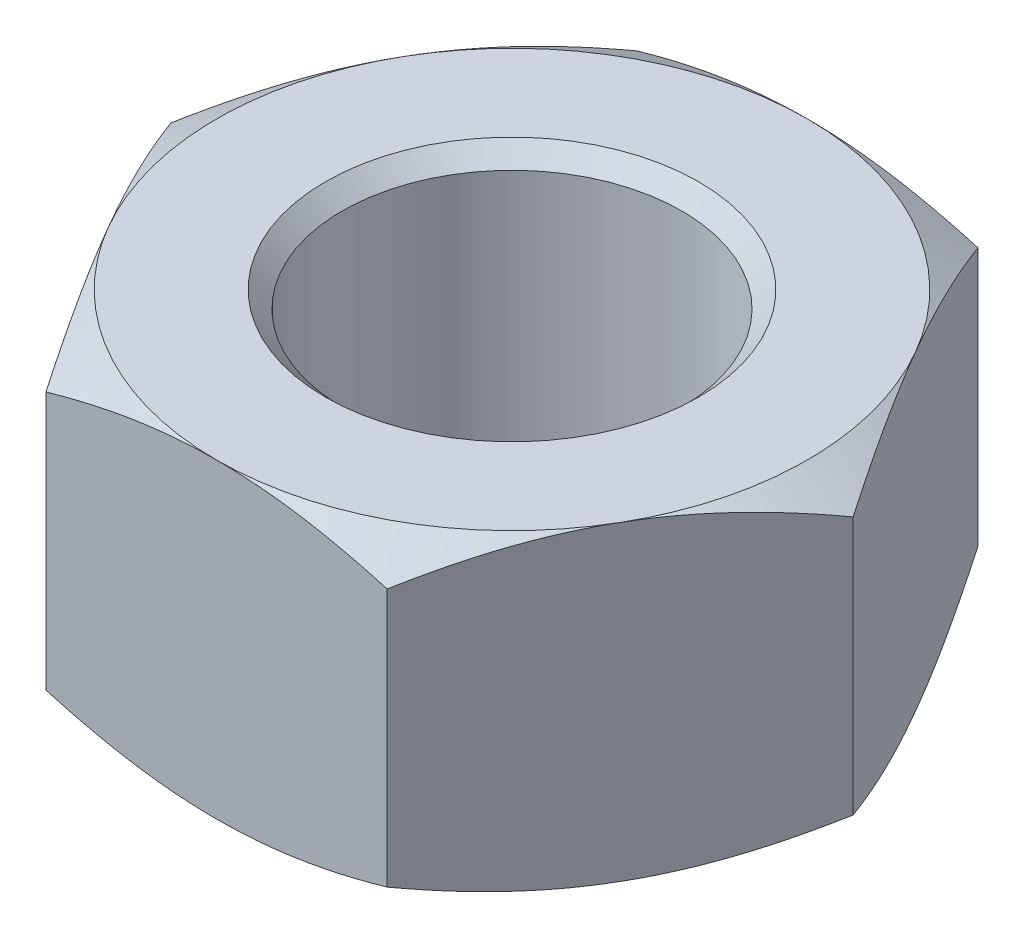
ISO-10303-21;
HEADER;
FILE_DESCRIPTION(('STEP AP214'),'2;1');
FILE_NAME('part.step','',(''),(''),'','','');
FILE_SCHEMA(('AUTOMOTIVE_DESIGN { 1 0 10303 214 1 1 1 1 }'));
ENDSEC;
DATA;
#1=APPLICATION_CONTEXT('core data for automotive mechanical design processes');
#2=APPLICATION_PROTOCOL_DEFINITION('international standard','automotive_design',2000,#1);
#3=PRODUCT_CONTEXT('',#1,'mechanical');
#4=PRODUCT('Part','Part','',(#3));
#5=PRODUCT_RELATED_PRODUCT_CATEGORY('part','',(#4));
#6=PRODUCT_DEFINITION_FORMATION('','',#4);
#7=PRODUCT_DEFINITION_CONTEXT('part definition',#1,'design');
#8=PRODUCT_DEFINITION('design','',#6,#7);
#9=PRODUCT_DEFINITION_SHAPE('','',#8);
#10=(LENGTH_UNIT() NAMED_UNIT(*) SI_UNIT(.MILLI.,.METRE.));
#11=(NAMED_UNIT(*) PLANE_ANGLE_UNIT() SI_UNIT($,.RADIAN.));
#12=(NAMED_UNIT(*) SI_UNIT($,.STERADIAN.) SOLID_ANGLE_UNIT());
#13=UNCERTAINTY_MEASURE_WITH_UNIT(LENGTH_MEASURE(1.E-05),#10,'distance_accuracy_value','');
#14=(GEOMETRIC_REPRESENTATION_CONTEXT(3) GLOBAL_UNCERTAINTY_ASSIGNED_CONTEXT((#13)) GLOBAL_UNIT_ASSIGNED_CONTEXT((#10,
#11,#12)) REPRESENTATION_CONTEXT('',''));
#15=CARTESIAN_POINT('',(0.,0.,0.));
#16=DIRECTION('',(0.,0.,1.));
#17=DIRECTION('',(1.,0.,0.));
#18=AXIS2_PLACEMENT_3D('',#15,#16,#17);
#19=CARTESIAN_POINT('',(-38.7727586640478,-29.,-4.75));
#20=DIRECTION('',(0.866025403784439,0.,-0.5));
#21=DIRECTION('',(-0.5,0.,-0.866025403784439));
#22=AXIS2_PLACEMENT_3D('',#19,#20,#21);
#23=PLANE('',#22);
#24=CARTESIAN_POINT('',(-41.5180162225476,-27.1498517286183,-9.50492557118405));
#25=CARTESIAN_POINT('',(-40.0466600833053,-28.,-6.95646198198795));
#26=CARTESIAN_POINT('',(-38.7727586640478,-28.,-4.75));
#27=CARTESIAN_POINT('',(-37.4988572447905,-28.,-2.54353801801205));
#28=CARTESIAN_POINT('',(-36.0275011055481,-27.1498517286183,0.00492557118405202));
#29=(BOUNDED_CURVE() B_SPLINE_CURVE(2,(#24,#25,#26,#27,#28),.UNSPECIFIED.,.F.,
.F.) B_SPLINE_CURVE_WITH_KNOTS((3,2,3),(0.,5.57015057763849,11.140301155277),
.UNSPECIFIED.) CURVE() GEOMETRIC_REPRESENTATION_ITEM() RATIONAL_B_SPLINE_CURVE((1.,
1.03802697460132,1.,1.03802697460132,1.)) REPRESENTATION_ITEM(''));
#30=CARTESIAN_POINT('',(-41.5151724426986,-27.1514942239681,-9.5));
#31=VERTEX_POINT('',#30);
#32=CARTESIAN_POINT('',(-38.7727586640478,-28.,-4.75));
#33=VERTEX_POINT('',#32);
#34=EDGE_CURVE('E120',#31,#33,#29,.T.);
#35=ORIENTED_EDGE('',*,*,#34,.F.);
#36=DIRECTION('',(0.,1.,0.));
#37=VECTOR('',#36,1.);
#38=CARTESIAN_POINT('',(-41.5151724426986,-29.,-9.5));
#39=LINE('',#38,#37);
#40=CARTESIAN_POINT('',(-41.5151724426986,-18.8485057760319,-9.5));
#41=VERTEX_POINT('',#40);
#42=EDGE_CURVE('E11',#31,#41,#39,.T.);
#43=ORIENTED_EDGE('',*,*,#42,.T.);
#44=CARTESIAN_POINT('',(-36.0275011055481,-18.8501482713817,0.00492557118405869));
#45=CARTESIAN_POINT('',(-37.4988572447904,-18.,-2.54353801801204));
#46=CARTESIAN_POINT('',(-38.7727586640478,-18.,-4.75));
#47=CARTESIAN_POINT('',(-40.0466600833052,-18.,-6.95646198198795));
#48=CARTESIAN_POINT('',(-41.5180162225476,-18.8501482713817,-9.50492557118406));
#49=(BOUNDED_CURVE() B_SPLINE_CURVE(2,(#44,#45,#46,#47,#48),.UNSPECIFIED.,.F.,
.F.) B_SPLINE_CURVE_WITH_KNOTS((3,2,3),(0.,5.57015057763849,11.140301155277),
.UNSPECIFIED.) CURVE() GEOMETRIC_REPRESENTATION_ITEM() RATIONAL_B_SPLINE_CURVE((1.,
1.03802697460132,1.,1.03802697460132,1.)) REPRESENTATION_ITEM(''));
#50=CARTESIAN_POINT('',(-38.7727586640478,-18.,-4.75));
#51=VERTEX_POINT('',#50);
#52=EDGE_CURVE('E204',#51,#41,#49,.T.);
#53=ORIENTED_EDGE('',*,*,#52,.F.);
#54=CARTESIAN_POINT('',(-36.0275011055481,-18.8501482713817,0.00492557118405869));
#55=CARTESIAN_POINT('',(-37.4988572447904,-18.,-2.54353801801204));
#56=CARTESIAN_POINT('',(-38.7727586640478,-18.,-4.75));
#57=CARTESIAN_POINT('',(-40.0466600833052,-18.,-6.95646198198795));
#58=CARTESIAN_POINT('',(-41.5180162225476,-18.8501482713817,-9.50492557118406));
#59=(BOUNDED_CURVE() B_SPLINE_CURVE(2,(#54,#55,#56,#57,#58),.UNSPECIFIED.,.F.,
.F.) B_SPLINE_CURVE_WITH_KNOTS((3,2,3),(0.,5.57015057763849,11.140301155277),
.UNSPECIFIED.) CURVE() GEOMETRIC_REPRESENTATION_ITEM() RATIONAL_B_SPLINE_CURVE((1.,
1.03802697460132,1.,1.03802697460132,1.)) REPRESENTATION_ITEM(''));
#60=CARTESIAN_POINT('',(-36.0303448853971,-18.8485057760319,0.));
#61=VERTEX_POINT('',#60);
#62=EDGE_CURVE('E305',#61,#51,#59,.T.);
#63=ORIENTED_EDGE('',*,*,#62,.F.);
#64=DIRECTION('',(0.,1.,0.));
#65=VECTOR('',#64,1.);
#66=CARTESIAN_POINT('',(-36.0303448853971,-29.,0.));
#67=LINE('',#66,#65);
#68=CARTESIAN_POINT('',(-36.0303448853971,-27.1514942239681,0.));
#69=VERTEX_POINT('',#68);
#70=EDGE_CURVE('E216',#69,#61,#67,.T.);
#71=ORIENTED_EDGE('',*,*,#70,.F.);
#72=CARTESIAN_POINT('',(-41.5180162225476,-27.1498517286183,-9.50492557118405));
#73=CARTESIAN_POINT('',(-40.0466600833053,-28.,-6.95646198198795));
#74=CARTESIAN_POINT('',(-38.7727586640478,-28.,-4.75));
#75=CARTESIAN_POINT('',(-37.4988572447905,-28.,-2.54353801801205));
#76=CARTESIAN_POINT('',(-36.0275011055481,-27.1498517286183,0.00492557118405202));
#77=(BOUNDED_CURVE() B_SPLINE_CURVE(2,(#72,#73,#74,#75,#76),.UNSPECIFIED.,.F.,
.F.) B_SPLINE_CURVE_WITH_KNOTS((3,2,3),(0.,5.57015057763849,11.140301155277),
.UNSPECIFIED.) CURVE() GEOMETRIC_REPRESENTATION_ITEM() RATIONAL_B_SPLINE_CURVE((1.,
1.03802697460132,1.,1.03802697460132,1.)) REPRESENTATION_ITEM(''));
#78=EDGE_CURVE('E123',#33,#69,#77,.T.);
#79=ORIENTED_EDGE('',*,*,#78,.F.);
#80=EDGE_LOOP('',(#35,#43,#53,#63,#71,#79));
#81=FACE_BOUND('',#80,.T.);
#82=ADVANCED_FACE('F16',(#81),#23,.T.);
#83=CARTESIAN_POINT('',(-47.,-29.,-9.5));
#84=DIRECTION('',(0.,0.,-1.));
#85=DIRECTION('',(-1.,0.,0.));
#86=AXIS2_PLACEMENT_3D('',#83,#84,#85);
#87=PLANE('',#86);
#88=CARTESIAN_POINT('',(-52.4905151169995,-27.1498517286183,-9.5));
#89=CARTESIAN_POINT('',(-49.5478028385149,-28.,-9.50000000000001));
#90=CARTESIAN_POINT('',(-47.,-28.,-9.5));
#91=CARTESIAN_POINT('',(-44.4521971614852,-28.,-9.50000000000001));
#92=CARTESIAN_POINT('',(-41.5094848830005,-27.1498517286183,-9.5));
#93=(BOUNDED_CURVE() B_SPLINE_CURVE(2,(#88,#89,#90,#91,#92),.UNSPECIFIED.,.F.,
.F.) B_SPLINE_CURVE_WITH_KNOTS((3,2,3),(0.,5.57015057763849,11.140301155277),
.UNSPECIFIED.) CURVE() GEOMETRIC_REPRESENTATION_ITEM() RATIONAL_B_SPLINE_CURVE((1.,
1.03802697460134,1.,1.03802697460134,1.)) REPRESENTATION_ITEM(''));
#94=CARTESIAN_POINT('',(-52.4848275573015,-27.1514942239681,-9.5));
#95=VERTEX_POINT('',#94);
#96=CARTESIAN_POINT('',(-47.,-28.,-9.5));
#97=VERTEX_POINT('',#96);
#98=EDGE_CURVE('E129',#95,#97,#93,.T.);
#99=ORIENTED_EDGE('',*,*,#98,.F.);
#100=DIRECTION('',(0.,1.,0.));
#101=VECTOR('',#100,1.);
#102=CARTESIAN_POINT('',(-52.4848275573015,-29.,-9.5));
#103=LINE('',#102,#101);
#104=CARTESIAN_POINT('',(-52.4848275573015,-18.8485057760319,-9.5));
#105=VERTEX_POINT('',#104);
#106=EDGE_CURVE('E28',#95,#105,#103,.T.);
#107=ORIENTED_EDGE('',*,*,#106,.T.);
#108=CARTESIAN_POINT('',(-41.5094848830005,-18.8501482713817,-9.5));
#109=CARTESIAN_POINT('',(-44.4521971614851,-18.,-9.50000000000001));
#110=CARTESIAN_POINT('',(-47.,-18.,-9.5));
#111=CARTESIAN_POINT('',(-49.5478028385149,-18.,-9.50000000000001));
#112=CARTESIAN_POINT('',(-52.4905151169995,-18.8501482713817,-9.5));
#113=(BOUNDED_CURVE() B_SPLINE_CURVE(2,(#108,#109,#110,#111,#112),.UNSPECIFIED.,.F.,
.F.) B_SPLINE_CURVE_WITH_KNOTS((3,2,3),(0.,5.5701505776385,11.140301155277),
.UNSPECIFIED.) CURVE() GEOMETRIC_REPRESENTATION_ITEM() RATIONAL_B_SPLINE_CURVE((1.,
1.03802697460132,1.,1.03802697460132,1.)) REPRESENTATION_ITEM(''));
#114=CARTESIAN_POINT('',(-47.,-18.,-9.5));
#115=VERTEX_POINT('',#114);
#116=EDGE_CURVE('E283',#115,#105,#113,.T.);
#117=ORIENTED_EDGE('',*,*,#116,.F.);
#118=CARTESIAN_POINT('',(-41.5094848830005,-18.8501482713817,-9.5));
#119=CARTESIAN_POINT('',(-44.4521971614851,-18.,-9.50000000000001));
#120=CARTESIAN_POINT('',(-47.,-18.,-9.5));
#121=CARTESIAN_POINT('',(-49.5478028385149,-18.,-9.50000000000001));
#122=CARTESIAN_POINT('',(-52.4905151169995,-18.8501482713817,-9.5));
#123=(BOUNDED_CURVE() B_SPLINE_CURVE(2,(#118,#119,#120,#121,#122),.UNSPECIFIED.,.F.,
.F.) B_SPLINE_CURVE_WITH_KNOTS((3,2,3),(0.,5.5701505776385,11.140301155277),
.UNSPECIFIED.) CURVE() GEOMETRIC_REPRESENTATION_ITEM() RATIONAL_B_SPLINE_CURVE((1.,
1.03802697460132,1.,1.03802697460132,1.)) REPRESENTATION_ITEM(''));
#124=EDGE_CURVE('E166',#41,#115,#123,.T.);
#125=ORIENTED_EDGE('',*,*,#124,.F.);
#126=ORIENTED_EDGE('',*,*,#42,.F.);
#127=CARTESIAN_POINT('',(-52.4905151169995,-27.1498517286183,-9.5));
#128=CARTESIAN_POINT('',(-49.5478028385149,-28.,-9.50000000000001));
#129=CARTESIAN_POINT('',(-47.,-28.,-9.5));
#130=CARTESIAN_POINT('',(-44.4521971614852,-28.,-9.50000000000001));
#131=CARTESIAN_POINT('',(-41.5094848830005,-27.1498517286183,-9.5));
#132=(BOUNDED_CURVE() B_SPLINE_CURVE(2,(#127,#128,#129,#130,#131),.UNSPECIFIED.,.F.,
.F.) B_SPLINE_CURVE_WITH_KNOTS((3,2,3),(0.,5.57015057763849,11.140301155277),
.UNSPECIFIED.) CURVE() GEOMETRIC_REPRESENTATION_ITEM() RATIONAL_B_SPLINE_CURVE((1.,
1.03802697460134,1.,1.03802697460134,1.)) REPRESENTATION_ITEM(''));
#133=EDGE_CURVE('E118',#97,#31,#132,.T.);
#134=ORIENTED_EDGE('',*,*,#133,.F.);
#135=EDGE_LOOP('',(#99,#107,#117,#125,#126,#134));
#136=FACE_BOUND('',#135,.T.);
#137=ADVANCED_FACE('F127',(#136),#87,.T.);
#138=CARTESIAN_POINT('',(-55.2272413359522,-29.,-4.75));
#139=DIRECTION('',(-0.866025403784439,0.,-0.5));
#140=DIRECTION('',(-0.5,0.,0.866025403784439));
#141=AXIS2_PLACEMENT_3D('',#138,#139,#140);
#142=PLANE('',#141);
#143=CARTESIAN_POINT('',(-57.9724988944519,-27.1498517286183,0.00492557118405107));
#144=CARTESIAN_POINT('',(-56.5011427552097,-28.,-2.54353801801205));
#145=CARTESIAN_POINT('',(-55.2272413359522,-28.,-4.75));
#146=CARTESIAN_POINT('',(-53.9533399166947,-28.,-6.95646198198796));
#147=CARTESIAN_POINT('',(-52.4819837774524,-27.1498517286183,-9.50492557118406));
#148=(BOUNDED_CURVE() B_SPLINE_CURVE(2,(#143,#144,#145,#146,#147),.UNSPECIFIED.,.F.,
.F.) B_SPLINE_CURVE_WITH_KNOTS((3,2,3),(0.,5.57015057763849,11.140301155277),
.UNSPECIFIED.) CURVE() GEOMETRIC_REPRESENTATION_ITEM() RATIONAL_B_SPLINE_CURVE((1.,
1.03802697460134,1.,1.03802697460135,1.)) REPRESENTATION_ITEM(''));
#149=CARTESIAN_POINT('',(-57.9696551146029,-27.1514942239681,0.));
#150=VERTEX_POINT('',#149);
#151=CARTESIAN_POINT('',(-55.2272413359522,-28.,-4.75));
#152=VERTEX_POINT('',#151);
#153=EDGE_CURVE('E178',#150,#152,#148,.T.);
#154=ORIENTED_EDGE('',*,*,#153,.F.);
#155=DIRECTION('',(0.,1.,0.));
#156=VECTOR('',#155,1.);
#157=CARTESIAN_POINT('',(-57.9696551146029,-29.,0.));
#158=LINE('',#157,#156);
#159=CARTESIAN_POINT('',(-57.9696551146029,-18.8485057760319,0.));
#160=VERTEX_POINT('',#159);
#161=EDGE_CURVE('E219',#150,#160,#158,.T.);
#162=ORIENTED_EDGE('',*,*,#161,.T.);
#163=CARTESIAN_POINT('',(-52.4819837774524,-18.8501482713817,-9.50492557118407));
#164=CARTESIAN_POINT('',(-53.9533399166948,-18.,-6.95646198198798));
#165=CARTESIAN_POINT('',(-55.2272413359522,-18.,-4.75));
#166=CARTESIAN_POINT('',(-56.5011427552097,-18.,-2.54353801801203));
#167=CARTESIAN_POINT('',(-57.9724988944519,-18.8501482713817,0.00492557118405964));
#168=(BOUNDED_CURVE() B_SPLINE_CURVE(2,(#163,#164,#165,#166,#167),.UNSPECIFIED.,.F.,
.F.) B_SPLINE_CURVE_WITH_KNOTS((3,2,3),(0.,5.5701505776385,11.140301155277),
.UNSPECIFIED.) CURVE() GEOMETRIC_REPRESENTATION_ITEM() RATIONAL_B_SPLINE_CURVE((1.,
1.03802697460132,1.,1.03802697460132,1.)) REPRESENTATION_ITEM(''));
#169=CARTESIAN_POINT('',(-55.2272413359522,-18.,-4.75));
#170=VERTEX_POINT('',#169);
#171=EDGE_CURVE('E242',#170,#160,#168,.T.);
#172=ORIENTED_EDGE('',*,*,#171,.F.);
#173=CARTESIAN_POINT('',(-52.4819837774524,-18.8501482713817,-9.50492557118407));
#174=CARTESIAN_POINT('',(-53.9533399166948,-18.,-6.95646198198798));
#175=CARTESIAN_POINT('',(-55.2272413359522,-18.,-4.75));
#176=CARTESIAN_POINT('',(-56.5011427552097,-18.,-2.54353801801203));
#177=CARTESIAN_POINT('',(-57.9724988944519,-18.8501482713817,0.00492557118405964));
#178=(BOUNDED_CURVE() B_SPLINE_CURVE(2,(#173,#174,#175,#176,#177),.UNSPECIFIED.,.F.,
.F.) B_SPLINE_CURVE_WITH_KNOTS((3,2,3),(0.,5.5701505776385,11.140301155277),
.UNSPECIFIED.) CURVE() GEOMETRIC_REPRESENTATION_ITEM() RATIONAL_B_SPLINE_CURVE((1.,
1.03802697460132,1.,1.03802697460132,1.)) REPRESENTATION_ITEM(''));
#179=EDGE_CURVE('E161',#105,#170,#178,.T.);
#180=ORIENTED_EDGE('',*,*,#179,.F.);
#181=ORIENTED_EDGE('',*,*,#106,.F.);
#182=CARTESIAN_POINT('',(-57.9724988944519,-27.1498517286183,0.00492557118405107));
#183=CARTESIAN_POINT('',(-56.5011427552097,-28.,-2.54353801801205));
#184=CARTESIAN_POINT('',(-55.2272413359522,-28.,-4.75));
#185=CARTESIAN_POINT('',(-53.9533399166947,-28.,-6.95646198198796));
#186=CARTESIAN_POINT('',(-52.4819837774524,-27.1498517286183,-9.50492557118406));
#187=(BOUNDED_CURVE() B_SPLINE_CURVE(2,(#182,#183,#184,#185,#186),.UNSPECIFIED.,.F.,
.F.) B_SPLINE_CURVE_WITH_KNOTS((3,2,3),(0.,5.57015057763849,11.140301155277),
.UNSPECIFIED.) CURVE() GEOMETRIC_REPRESENTATION_ITEM() RATIONAL_B_SPLINE_CURVE((1.,
1.03802697460134,1.,1.03802697460135,1.)) REPRESENTATION_ITEM(''));
#188=EDGE_CURVE('E144',#152,#95,#187,.T.);
#189=ORIENTED_EDGE('',*,*,#188,.F.);
#190=EDGE_LOOP('',(#154,#162,#172,#180,#181,#189));
#191=FACE_BOUND('',#190,.T.);
#192=ADVANCED_FACE('F400',(#191),#142,.T.);
#193=CARTESIAN_POINT('',(-38.7727586640478,-29.,4.75));
#194=DIRECTION('',(0.866025403784439,0.,0.5));
#195=DIRECTION('',(0.5,0.,-0.866025403784439));
#196=AXIS2_PLACEMENT_3D('',#193,#194,#195);
#197=PLANE('',#196);
#198=CARTESIAN_POINT('',(-36.0275011055481,-27.1498517286183,-0.00492557118405583));
#199=CARTESIAN_POINT('',(-37.4988572447904,-28.,2.54353801801203));
#200=CARTESIAN_POINT('',(-38.7727586640478,-28.,4.75));
#201=CARTESIAN_POINT('',(-40.0466600833052,-28.,6.95646198198796));
#202=CARTESIAN_POINT('',(-41.5180162225476,-27.1498517286183,9.50492557118405));
#203=(BOUNDED_CURVE() B_SPLINE_CURVE(2,(#198,#199,#200,#201,#202),.UNSPECIFIED.,.F.,
.F.) B_SPLINE_CURVE_WITH_KNOTS((3,2,3),(0.,5.57015057763849,11.140301155277),
.UNSPECIFIED.) CURVE() GEOMETRIC_REPRESENTATION_ITEM() RATIONAL_B_SPLINE_CURVE((1.,
1.03802697460133,1.,1.03802697460135,1.)) REPRESENTATION_ITEM(''));
#204=CARTESIAN_POINT('',(-38.7727586640478,-28.,4.75));
#205=VERTEX_POINT('',#204);
#206=CARTESIAN_POINT('',(-41.5151724426986,-27.1514942239681,9.5));
#207=VERTEX_POINT('',#206);
#208=EDGE_CURVE('E152',#205,#207,#203,.T.);
#209=ORIENTED_EDGE('',*,*,#208,.F.);
#210=CARTESIAN_POINT('',(-36.0275011055481,-27.1498517286183,-0.00492557118405583));
#211=CARTESIAN_POINT('',(-37.4988572447904,-28.,2.54353801801203));
#212=CARTESIAN_POINT('',(-38.7727586640478,-28.,4.75));
#213=CARTESIAN_POINT('',(-40.0466600833052,-28.,6.95646198198796));
#214=CARTESIAN_POINT('',(-41.5180162225476,-27.1498517286183,9.50492557118405));
#215=(BOUNDED_CURVE() B_SPLINE_CURVE(2,(#210,#211,#212,#213,#214),.UNSPECIFIED.,.F.,
.F.) B_SPLINE_CURVE_WITH_KNOTS((3,2,3),(0.,5.57015057763849,11.140301155277),
.UNSPECIFIED.) CURVE() GEOMETRIC_REPRESENTATION_ITEM() RATIONAL_B_SPLINE_CURVE((1.,
1.03802697460133,1.,1.03802697460135,1.)) REPRESENTATION_ITEM(''));
#216=EDGE_CURVE('E162',#69,#205,#215,.T.);
#217=ORIENTED_EDGE('',*,*,#216,.F.);
#218=ORIENTED_EDGE('',*,*,#70,.T.);
#219=CARTESIAN_POINT('',(-41.5180162225476,-18.8501482713817,9.50492557118406));
#220=CARTESIAN_POINT('',(-40.0466600833053,-18.,6.95646198198797));
#221=CARTESIAN_POINT('',(-38.7727586640478,-18.,4.75));
#222=CARTESIAN_POINT('',(-37.4988572447904,-18.,2.54353801801203));
#223=CARTESIAN_POINT('',(-36.0275011055481,-18.8501482713817,-0.00492557118406345));
#224=(BOUNDED_CURVE() B_SPLINE_CURVE(2,(#219,#220,#221,#222,#223),.UNSPECIFIED.,.F.,
.F.) B_SPLINE_CURVE_WITH_KNOTS((3,2,3),(0.,5.5701505776385,11.140301155277),
.UNSPECIFIED.) CURVE() GEOMETRIC_REPRESENTATION_ITEM() RATIONAL_B_SPLINE_CURVE((1.,
1.03802697460133,1.,1.03802697460134,1.)) REPRESENTATION_ITEM(''));
#225=CARTESIAN_POINT('',(-38.7727586640478,-18.,4.75));
#226=VERTEX_POINT('',#225);
#227=EDGE_CURVE('E20',#226,#61,#224,.T.);
#228=ORIENTED_EDGE('',*,*,#227,.F.);
#229=CARTESIAN_POINT('',(-41.5180162225476,-18.8501482713817,9.50492557118406));
#230=CARTESIAN_POINT('',(-40.0466600833053,-18.,6.95646198198797));
#231=CARTESIAN_POINT('',(-38.7727586640478,-18.,4.75));
#232=CARTESIAN_POINT('',(-37.4988572447904,-18.,2.54353801801203));
#233=CARTESIAN_POINT('',(-36.0275011055481,-18.8501482713817,-0.00492557118406345));
#234=(BOUNDED_CURVE() B_SPLINE_CURVE(2,(#229,#230,#231,#232,#233),.UNSPECIFIED.,.F.,
.F.) B_SPLINE_CURVE_WITH_KNOTS((3,2,3),(0.,5.5701505776385,11.140301155277),
.UNSPECIFIED.) CURVE() GEOMETRIC_REPRESENTATION_ITEM() RATIONAL_B_SPLINE_CURVE((1.,
1.03802697460133,1.,1.03802697460134,1.)) REPRESENTATION_ITEM(''));
#235=CARTESIAN_POINT('',(-41.5151724426986,-18.8485057760319,9.5));
#236=VERTEX_POINT('',#235);
#237=EDGE_CURVE('E334',#236,#226,#234,.T.);
#238=ORIENTED_EDGE('',*,*,#237,.F.);
#239=DIRECTION('',(0.,1.,0.));
#240=VECTOR('',#239,1.);
#241=CARTESIAN_POINT('',(-41.5151724426986,-29.,9.5));
#242=LINE('',#241,#240);
#243=EDGE_CURVE('E217',#207,#236,#242,.T.);
#244=ORIENTED_EDGE('',*,*,#243,.F.);
#245=EDGE_LOOP('',(#209,#217,#218,#228,#238,#244));
#246=FACE_BOUND('',#245,.T.);
#247=ADVANCED_FACE('F368',(#246),#197,.T.);
#248=CARTESIAN_POINT('',(-47.,-29.,9.5));
#249=DIRECTION('',(0.,0.,1.));
#250=DIRECTION('',(1.,0.,0.));
#251=AXIS2_PLACEMENT_3D('',#248,#249,#250);
#252=PLANE('',#251);
#253=CARTESIAN_POINT('',(-41.5094848830005,-27.1498517286183,9.5));
#254=CARTESIAN_POINT('',(-44.4521971614851,-28.,9.5));
#255=CARTESIAN_POINT('',(-47.,-28.,9.5));
#256=CARTESIAN_POINT('',(-49.5478028385148,-28.,9.49999999999999));
#257=CARTESIAN_POINT('',(-52.4905151169995,-27.1498517286183,9.5));
#258=(BOUNDED_CURVE() B_SPLINE_CURVE(2,(#253,#254,#255,#256,#257),.UNSPECIFIED.,.F.,
.F.) B_SPLINE_CURVE_WITH_KNOTS((3,2,3),(0.,5.5701505776385,11.140301155277),
.UNSPECIFIED.) CURVE() GEOMETRIC_REPRESENTATION_ITEM() RATIONAL_B_SPLINE_CURVE((1.,
1.03802697460134,1.,1.03802697460134,1.)) REPRESENTATION_ITEM(''));
#259=CARTESIAN_POINT('',(-47.,-28.,9.5));
#260=VERTEX_POINT('',#259);
#261=CARTESIAN_POINT('',(-52.4848275573015,-27.1514942239681,9.5));
#262=VERTEX_POINT('',#261);
#263=EDGE_CURVE('E176',#260,#262,#258,.T.);
#264=ORIENTED_EDGE('',*,*,#263,.F.);
#265=CARTESIAN_POINT('',(-41.5094848830005,-27.1498517286183,9.5));
#266=CARTESIAN_POINT('',(-44.4521971614851,-28.,9.5));
#267=CARTESIAN_POINT('',(-47.,-28.,9.5));
#268=CARTESIAN_POINT('',(-49.5478028385148,-28.,9.49999999999999));
#269=CARTESIAN_POINT('',(-52.4905151169995,-27.1498517286183,9.5));
#270=(BOUNDED_CURVE() B_SPLINE_CURVE(2,(#265,#266,#267,#268,#269),.UNSPECIFIED.,.F.,
.F.) B_SPLINE_CURVE_WITH_KNOTS((3,2,3),(0.,5.5701505776385,11.140301155277),
.UNSPECIFIED.) CURVE() GEOMETRIC_REPRESENTATION_ITEM() RATIONAL_B_SPLINE_CURVE((1.,
1.03802697460134,1.,1.03802697460134,1.)) REPRESENTATION_ITEM(''));
#271=EDGE_CURVE('E222',#207,#260,#270,.T.);
#272=ORIENTED_EDGE('',*,*,#271,.F.);
#273=ORIENTED_EDGE('',*,*,#243,.T.);
#274=CARTESIAN_POINT('',(-52.4905151169995,-18.8501482713817,9.5));
#275=CARTESIAN_POINT('',(-49.5478028385149,-18.,9.5));
#276=CARTESIAN_POINT('',(-47.,-18.,9.5));
#277=CARTESIAN_POINT('',(-44.4521971614851,-18.,9.5));
#278=CARTESIAN_POINT('',(-41.5094848830005,-18.8501482713817,9.5));
#279=(BOUNDED_CURVE() B_SPLINE_CURVE(2,(#274,#275,#276,#277,#278),.UNSPECIFIED.,.F.,
.F.) B_SPLINE_CURVE_WITH_KNOTS((3,2,3),(0.,5.5701505776385,11.140301155277),
.UNSPECIFIED.) CURVE() GEOMETRIC_REPRESENTATION_ITEM() RATIONAL_B_SPLINE_CURVE((1.,
1.03802697460136,1.,1.03802697460136,1.)) REPRESENTATION_ITEM(''));
#280=CARTESIAN_POINT('',(-47.,-18.,9.5));
#281=VERTEX_POINT('',#280);
#282=EDGE_CURVE('E263',#281,#236,#279,.T.);
#283=ORIENTED_EDGE('',*,*,#282,.F.);
#284=CARTESIAN_POINT('',(-52.4905151169995,-18.8501482713817,9.5));
#285=CARTESIAN_POINT('',(-49.5478028385149,-18.,9.5));
#286=CARTESIAN_POINT('',(-47.,-18.,9.5));
#287=CARTESIAN_POINT('',(-44.4521971614851,-18.,9.5));
#288=CARTESIAN_POINT('',(-41.5094848830005,-18.8501482713817,9.5));
#289=(BOUNDED_CURVE() B_SPLINE_CURVE(2,(#284,#285,#286,#287,#288),.UNSPECIFIED.,.F.,
.F.) B_SPLINE_CURVE_WITH_KNOTS((3,2,3),(0.,5.5701505776385,11.140301155277),
.UNSPECIFIED.) CURVE() GEOMETRIC_REPRESENTATION_ITEM() RATIONAL_B_SPLINE_CURVE((1.,
1.03802697460136,1.,1.03802697460136,1.)) REPRESENTATION_ITEM(''));
#290=CARTESIAN_POINT('',(-52.4848275573015,-18.8485057760319,9.5));
#291=VERTEX_POINT('',#290);
#292=EDGE_CURVE('E247',#291,#281,#289,.T.);
#293=ORIENTED_EDGE('',*,*,#292,.F.);
#294=DIRECTION('',(0.,1.,0.));
#295=VECTOR('',#294,1.);
#296=CARTESIAN_POINT('',(-52.4848275573015,-29.,9.5));
#297=LINE('',#296,#295);
#298=EDGE_CURVE('E221',#262,#291,#297,.T.);
#299=ORIENTED_EDGE('',*,*,#298,.F.);
#300=EDGE_LOOP('',(#264,#272,#273,#283,#293,#299));
#301=FACE_BOUND('',#300,.T.);
#302=ADVANCED_FACE('F382',(#301),#252,.T.);
#303=CARTESIAN_POINT('',(-55.2272413359522,-29.,4.75));
#304=DIRECTION('',(-0.866025403784439,0.,0.5));
#305=DIRECTION('',(0.5,0.,0.866025403784439));
#306=AXIS2_PLACEMENT_3D('',#303,#304,#305);
#307=PLANE('',#306);
#308=CARTESIAN_POINT('',(-52.4819837774524,-27.1498517286183,9.50492557118405));
#309=CARTESIAN_POINT('',(-53.9533399166948,-28.,6.95646198198795));
#310=CARTESIAN_POINT('',(-55.2272413359522,-28.,4.75));
#311=CARTESIAN_POINT('',(-56.5011427552096,-28.,2.54353801801204));
#312=CARTESIAN_POINT('',(-57.9724988944519,-27.1498517286183,-0.00492557118405964));
#313=(BOUNDED_CURVE() B_SPLINE_CURVE(2,(#308,#309,#310,#311,#312),.UNSPECIFIED.,.F.,
.F.) B_SPLINE_CURVE_WITH_KNOTS((3,2,3),(0.,5.57015057763849,11.140301155277),
.UNSPECIFIED.) CURVE() GEOMETRIC_REPRESENTATION_ITEM() RATIONAL_B_SPLINE_CURVE((1.,
1.03802697460133,1.,1.03802697460134,1.)) REPRESENTATION_ITEM(''));
#314=CARTESIAN_POINT('',(-55.2272413359522,-28.,4.75));
#315=VERTEX_POINT('',#314);
#316=EDGE_CURVE('E146',#315,#150,#313,.T.);
#317=ORIENTED_EDGE('',*,*,#316,.F.);
#318=CARTESIAN_POINT('',(-52.4819837774524,-27.1498517286183,9.50492557118405));
#319=CARTESIAN_POINT('',(-53.9533399166948,-28.,6.95646198198795));
#320=CARTESIAN_POINT('',(-55.2272413359522,-28.,4.75));
#321=CARTESIAN_POINT('',(-56.5011427552096,-28.,2.54353801801204));
#322=CARTESIAN_POINT('',(-57.9724988944519,-27.1498517286183,-0.00492557118405964));
#323=(BOUNDED_CURVE() B_SPLINE_CURVE(2,(#318,#319,#320,#321,#322),.UNSPECIFIED.,.F.,
.F.) B_SPLINE_CURVE_WITH_KNOTS((3,2,3),(0.,5.57015057763849,11.140301155277),
.UNSPECIFIED.) CURVE() GEOMETRIC_REPRESENTATION_ITEM() RATIONAL_B_SPLINE_CURVE((1.,
1.03802697460133,1.,1.03802697460134,1.)) REPRESENTATION_ITEM(''));
#324=EDGE_CURVE('E177',#262,#315,#323,.T.);
#325=ORIENTED_EDGE('',*,*,#324,.F.);
#326=ORIENTED_EDGE('',*,*,#298,.T.);
#327=CARTESIAN_POINT('',(-57.9724988944519,-18.8501482713817,-0.00492557118406345));
#328=CARTESIAN_POINT('',(-56.5011427552095,-18.,2.54353801801203));
#329=CARTESIAN_POINT('',(-55.2272413359522,-18.,4.75));
#330=CARTESIAN_POINT('',(-53.9533399166947,-18.,6.95646198198796));
#331=CARTESIAN_POINT('',(-52.4819837774524,-18.8501482713817,9.50492557118406));
#332=(BOUNDED_CURVE() B_SPLINE_CURVE(2,(#327,#328,#329,#330,#331),.UNSPECIFIED.,.F.,
.F.) B_SPLINE_CURVE_WITH_KNOTS((3,2,3),(0.,5.57015057763849,11.140301155277),
.UNSPECIFIED.) CURVE() GEOMETRIC_REPRESENTATION_ITEM() RATIONAL_B_SPLINE_CURVE((1.,
1.03802697460132,1.,1.03802697460134,1.)) REPRESENTATION_ITEM(''));
#333=CARTESIAN_POINT('',(-55.2272413359522,-18.,4.75));
#334=VERTEX_POINT('',#333);
#335=EDGE_CURVE('E258',#334,#291,#332,.T.);
#336=ORIENTED_EDGE('',*,*,#335,.F.);
#337=CARTESIAN_POINT('',(-57.9724988944519,-18.8501482713817,-0.00492557118406345));
#338=CARTESIAN_POINT('',(-56.5011427552095,-18.,2.54353801801203));
#339=CARTESIAN_POINT('',(-55.2272413359522,-18.,4.75));
#340=CARTESIAN_POINT('',(-53.9533399166947,-18.,6.95646198198796));
#341=CARTESIAN_POINT('',(-52.4819837774524,-18.8501482713817,9.50492557118406));
#342=(BOUNDED_CURVE() B_SPLINE_CURVE(2,(#337,#338,#339,#340,#341),.UNSPECIFIED.,.F.,
.F.) B_SPLINE_CURVE_WITH_KNOTS((3,2,3),(0.,5.57015057763849,11.140301155277),
.UNSPECIFIED.) CURVE() GEOMETRIC_REPRESENTATION_ITEM() RATIONAL_B_SPLINE_CURVE((1.,
1.03802697460132,1.,1.03802697460134,1.)) REPRESENTATION_ITEM(''));
#343=EDGE_CURVE('E243',#160,#334,#342,.T.);
#344=ORIENTED_EDGE('',*,*,#343,.F.);
#345=ORIENTED_EDGE('',*,*,#161,.F.);
#346=EDGE_LOOP('',(#317,#325,#326,#336,#344,#345));
#347=FACE_BOUND('',#346,.T.);
#348=ADVANCED_FACE('F420',(#347),#307,.T.);
#349=CARTESIAN_POINT('',(-39.25,-28.,0.));
#350=DIRECTION('',(0.,-1.,0.));
#351=DIRECTION('',(-1.,0.,0.));
#352=AXIS2_PLACEMENT_3D('',#349,#350,#351);
#353=PLANE('',#352);
#354=CARTESIAN_POINT('',(-47.,-28.,0.));
#355=DIRECTION('',(0.,1.,0.));
#356=DIRECTION('',(1.,0.,0.));
#357=AXIS2_PLACEMENT_3D('',#354,#355,#356);
#358=CIRCLE('',#357,6.);
#359=CARTESIAN_POINT('',(-41.,-28.,0.));
#360=VERTEX_POINT('',#359);
#361=EDGE_CURVE('E34',#360,#360,#358,.T.);
#362=ORIENTED_EDGE('',*,*,#361,.T.);
#363=EDGE_LOOP('',(#362));
#364=FACE_BOUND('',#363,.T.);
#365=CARTESIAN_POINT('',(-47.,-28.,0.));
#366=DIRECTION('',(0.,1.,0.));
#367=DIRECTION('',(1.,0.,0.));
#368=AXIS2_PLACEMENT_3D('',#365,#366,#367);
#369=CIRCLE('',#368,9.5);
#370=EDGE_CURVE('E156',#205,#33,#369,.T.);
#371=ORIENTED_EDGE('',*,*,#370,.F.);
#372=CARTESIAN_POINT('',(-47.,-28.,0.));
#373=DIRECTION('',(0.,1.,0.));
#374=DIRECTION('',(1.,0.,0.));
#375=AXIS2_PLACEMENT_3D('',#372,#373,#374);
#376=CIRCLE('',#375,9.5);
#377=EDGE_CURVE('E227',#260,#205,#376,.T.);
#378=ORIENTED_EDGE('',*,*,#377,.F.);
#379=CARTESIAN_POINT('',(-47.,-28.,0.));
#380=DIRECTION('',(0.,1.,0.));
#381=DIRECTION('',(1.,0.,0.));
#382=AXIS2_PLACEMENT_3D('',#379,#380,#381);
#383=CIRCLE('',#382,9.5);
#384=EDGE_CURVE('E170',#315,#260,#383,.T.);
#385=ORIENTED_EDGE('',*,*,#384,.F.);
#386=CARTESIAN_POINT('',(-47.,-28.,0.));
#387=DIRECTION('',(0.,1.,0.));
#388=DIRECTION('',(1.,0.,0.));
#389=AXIS2_PLACEMENT_3D('',#386,#387,#388);
#390=CIRCLE('',#389,9.5);
#391=EDGE_CURVE('E138',#152,#315,#390,.T.);
#392=ORIENTED_EDGE('',*,*,#391,.F.);
#393=CARTESIAN_POINT('',(-47.,-28.,0.));
#394=DIRECTION('',(0.,1.,0.));
#395=DIRECTION('',(1.,0.,0.));
#396=AXIS2_PLACEMENT_3D('',#393,#394,#395);
#397=CIRCLE('',#396,9.5);
#398=EDGE_CURVE('E132',#97,#152,#397,.T.);
#399=ORIENTED_EDGE('',*,*,#398,.F.);
#400=CARTESIAN_POINT('',(-47.,-28.,0.));
#401=DIRECTION('',(0.,1.,0.));
#402=DIRECTION('',(1.,0.,0.));
#403=AXIS2_PLACEMENT_3D('',#400,#401,#402);
#404=CIRCLE('',#403,9.5);
#405=EDGE_CURVE('E116',#33,#97,#404,.T.);
#406=ORIENTED_EDGE('',*,*,#405,.F.);
#407=EDGE_LOOP('',(#371,#378,#385,#392,#399,#406));
#408=FACE_BOUND('',#407,.T.);
#409=ADVANCED_FACE('F135',(#364,#408),#353,.T.);
#410=CARTESIAN_POINT('',(-47.,-27.729375,0.));
#411=DIRECTION('',(0.,-1.,0.));
#412=DIRECTION('',(1.,0.,0.));
#413=AXIS2_PLACEMENT_3D('',#410,#411,#412);
#414=CONICAL_SURFACE('',#413,5.729375,0.785398163397448);
#415=CARTESIAN_POINT('',(-47.,-27.45875,0.));
#416=DIRECTION('',(0.,1.,0.));
#417=DIRECTION('',(1.,0.,0.));
#418=AXIS2_PLACEMENT_3D('',#415,#416,#417);
#419=CIRCLE('',#418,5.45875);
#420=CARTESIAN_POINT('',(-41.54125,-27.45875,0.));
#421=VERTEX_POINT('',#420);
#422=EDGE_CURVE('E244',#421,#421,#419,.T.);
#423=ORIENTED_EDGE('',*,*,#422,.T.);
#424=EDGE_LOOP('',(#423));
#425=FACE_BOUND('',#424,.T.);
#426=ORIENTED_EDGE('',*,*,#361,.F.);
#427=EDGE_LOOP('',(#426));
#428=FACE_BOUND('',#427,.T.);
#429=ADVANCED_FACE('F419',(#425,#428),#414,.F.);
#430=CARTESIAN_POINT('',(-47.,-23.,0.));
#431=DIRECTION('',(0.,-1.,0.));
#432=DIRECTION('',(1.,0.,0.));
#433=AXIS2_PLACEMENT_3D('',#430,#431,#432);
#434=CYLINDRICAL_SURFACE('',#433,5.45875);
#435=CARTESIAN_POINT('',(-47.,-18.54125,0.));
#436=DIRECTION('',(0.,1.,0.));
#437=DIRECTION('',(1.,0.,0.));
#438=AXIS2_PLACEMENT_3D('',#435,#436,#437);
#439=CIRCLE('',#438,5.45875);
#440=CARTESIAN_POINT('',(-41.54125,-18.54125,0.));
#441=VERTEX_POINT('',#440);
#442=EDGE_CURVE('E246',#441,#441,#439,.T.);
#443=ORIENTED_EDGE('',*,*,#442,.T.);
#444=EDGE_LOOP('',(#443));
#445=FACE_BOUND('',#444,.T.);
#446=ORIENTED_EDGE('',*,*,#422,.F.);
#447=EDGE_LOOP('',(#446));
#448=FACE_BOUND('',#447,.T.);
#449=ADVANCED_FACE('F423',(#445,#448),#434,.F.);
#450=CARTESIAN_POINT('',(-47.,-18.270625,0.));
#451=DIRECTION('',(0.,1.,0.));
#452=DIRECTION('',(1.,0.,0.));
#453=AXIS2_PLACEMENT_3D('',#450,#451,#452);
#454=CONICAL_SURFACE('',#453,5.729375,0.785398163397448);
#455=CARTESIAN_POINT('',(-47.,-18.,0.));
#456=DIRECTION('',(0.,1.,0.));
#457=DIRECTION('',(1.,0.,0.));
#458=AXIS2_PLACEMENT_3D('',#455,#456,#457);
#459=CIRCLE('',#458,6.);
#460=CARTESIAN_POINT('',(-41.,-18.,0.));
#461=VERTEX_POINT('',#460);
#462=EDGE_CURVE('E165',#461,#461,#459,.T.);
#463=ORIENTED_EDGE('',*,*,#462,.T.);
#464=EDGE_LOOP('',(#463));
#465=FACE_BOUND('',#464,.T.);
#466=ORIENTED_EDGE('',*,*,#442,.F.);
#467=EDGE_LOOP('',(#466));
#468=FACE_BOUND('',#467,.T.);
#469=ADVANCED_FACE('F409',(#465,#468),#454,.F.);
#470=CARTESIAN_POINT('',(-39.25,-18.,0.));
#471=DIRECTION('',(0.,1.,0.));
#472=DIRECTION('',(1.,0.,0.));
#473=AXIS2_PLACEMENT_3D('',#470,#471,#472);
#474=PLANE('',#473);
#475=CARTESIAN_POINT('',(-47.,-18.,0.));
#476=DIRECTION('',(0.,1.,0.));
#477=DIRECTION('',(1.,0.,0.));
#478=AXIS2_PLACEMENT_3D('',#475,#476,#477);
#479=CIRCLE('',#478,9.5);
#480=EDGE_CURVE('E304',#226,#51,#479,.T.);
#481=ORIENTED_EDGE('',*,*,#480,.T.);
#482=CARTESIAN_POINT('',(-47.,-18.,0.));
#483=DIRECTION('',(0.,1.,0.));
#484=DIRECTION('',(1.,0.,0.));
#485=AXIS2_PLACEMENT_3D('',#482,#483,#484);
#486=CIRCLE('',#485,9.5);
#487=EDGE_CURVE('E163',#51,#115,#486,.T.);
#488=ORIENTED_EDGE('',*,*,#487,.T.);
#489=CARTESIAN_POINT('',(-47.,-18.,0.));
#490=DIRECTION('',(0.,1.,0.));
#491=DIRECTION('',(1.,0.,0.));
#492=AXIS2_PLACEMENT_3D('',#489,#490,#491);
#493=CIRCLE('',#492,9.5);
#494=EDGE_CURVE('E235',#115,#170,#493,.T.);
#495=ORIENTED_EDGE('',*,*,#494,.T.);
#496=CARTESIAN_POINT('',(-47.,-18.,0.));
#497=DIRECTION('',(0.,1.,0.));
#498=DIRECTION('',(1.,0.,0.));
#499=AXIS2_PLACEMENT_3D('',#496,#497,#498);
#500=CIRCLE('',#499,9.5);
#501=EDGE_CURVE('E236',#170,#334,#500,.T.);
#502=ORIENTED_EDGE('',*,*,#501,.T.);
#503=CARTESIAN_POINT('',(-47.,-18.,0.));
#504=DIRECTION('',(0.,1.,0.));
#505=DIRECTION('',(1.,0.,0.));
#506=AXIS2_PLACEMENT_3D('',#503,#504,#505);
#507=CIRCLE('',#506,9.5);
#508=EDGE_CURVE('E252',#334,#281,#507,.T.);
#509=ORIENTED_EDGE('',*,*,#508,.T.);
#510=CARTESIAN_POINT('',(-47.,-18.,0.));
#511=DIRECTION('',(0.,1.,0.));
#512=DIRECTION('',(1.,0.,0.));
#513=AXIS2_PLACEMENT_3D('',#510,#511,#512);
#514=CIRCLE('',#513,9.5);
#515=EDGE_CURVE('E328',#281,#226,#514,.T.);
#516=ORIENTED_EDGE('',*,*,#515,.T.);
#517=EDGE_LOOP('',(#481,#488,#495,#502,#509,#516));
#518=FACE_BOUND('',#517,.T.);
#519=ORIENTED_EDGE('',*,*,#462,.F.);
#520=EDGE_LOOP('',(#519));
#521=FACE_BOUND('',#520,.T.);
#522=ADVANCED_FACE('F374',(#518,#521),#474,.T.);
#523=CARTESIAN_POINT('',(-47.,-18.4250741356908,0.));
#524=DIRECTION('',(0.,-1.,0.));
#525=DIRECTION('',(1.,0.,0.));
#526=AXIS2_PLACEMENT_3D('',#523,#524,#525);
#527=CONICAL_SURFACE('',#526,10.23625,1.0471975511966);
#528=ORIENTED_EDGE('',*,*,#52,.T.);
#529=ORIENTED_EDGE('',*,*,#124,.T.);
#530=ORIENTED_EDGE('',*,*,#487,.F.);
#531=EDGE_LOOP('',(#528,#529,#530));
#532=FACE_BOUND('',#531,.T.);
#533=ADVANCED_FACE('F408',(#532),#527,.T.);
#534=CARTESIAN_POINT('',(-47.,-18.4250741356908,0.));
#535=DIRECTION('',(0.,-1.,0.));
#536=DIRECTION('',(1.,0.,0.));
#537=AXIS2_PLACEMENT_3D('',#534,#535,#536);
#538=CONICAL_SURFACE('',#537,10.23625,1.0471975511966);
#539=ORIENTED_EDGE('',*,*,#227,.T.);
#540=ORIENTED_EDGE('',*,*,#62,.T.);
#541=ORIENTED_EDGE('',*,*,#480,.F.);
#542=EDGE_LOOP('',(#539,#540,#541));
#543=FACE_BOUND('',#542,.T.);
#544=ADVANCED_FACE('F428',(#543),#538,.T.);
#545=CARTESIAN_POINT('',(-47.,-18.4250741356908,0.));
#546=DIRECTION('',(0.,-1.,0.));
#547=DIRECTION('',(1.,0.,0.));
#548=AXIS2_PLACEMENT_3D('',#545,#546,#547);
#549=CONICAL_SURFACE('',#548,10.23625,1.0471975511966);
#550=ORIENTED_EDGE('',*,*,#282,.T.);
#551=ORIENTED_EDGE('',*,*,#237,.T.);
#552=ORIENTED_EDGE('',*,*,#515,.F.);
#553=EDGE_LOOP('',(#550,#551,#552));
#554=FACE_BOUND('',#553,.T.);
#555=ADVANCED_FACE('F364',(#554),#549,.T.);
#556=CARTESIAN_POINT('',(-47.,-18.4250741356908,0.));
#557=DIRECTION('',(0.,-1.,0.));
#558=DIRECTION('',(1.,0.,0.));
#559=AXIS2_PLACEMENT_3D('',#556,#557,#558);
#560=CONICAL_SURFACE('',#559,10.23625,1.0471975511966);
#561=ORIENTED_EDGE('',*,*,#292,.T.);
#562=ORIENTED_EDGE('',*,*,#508,.F.);
#563=ORIENTED_EDGE('',*,*,#335,.T.);
#564=EDGE_LOOP('',(#561,#562,#563));
#565=FACE_BOUND('',#564,.T.);
#566=ADVANCED_FACE('F380',(#565),#560,.T.);
#567=CARTESIAN_POINT('',(-47.,-18.4250741356908,0.));
#568=DIRECTION('',(0.,-1.,0.));
#569=DIRECTION('',(1.,0.,0.));
#570=AXIS2_PLACEMENT_3D('',#567,#568,#569);
#571=CONICAL_SURFACE('',#570,10.23625,1.0471975511966);
#572=ORIENTED_EDGE('',*,*,#343,.T.);
#573=ORIENTED_EDGE('',*,*,#501,.F.);
#574=ORIENTED_EDGE('',*,*,#171,.T.);
#575=EDGE_LOOP('',(#572,#573,#574));
#576=FACE_BOUND('',#575,.T.);
#577=ADVANCED_FACE('F405',(#576),#571,.T.);
#578=CARTESIAN_POINT('',(-47.,-18.4250741356908,0.));
#579=DIRECTION('',(0.,-1.,0.));
#580=DIRECTION('',(1.,0.,0.));
#581=AXIS2_PLACEMENT_3D('',#578,#579,#580);
#582=CONICAL_SURFACE('',#581,10.23625,1.0471975511966);
#583=ORIENTED_EDGE('',*,*,#179,.T.);
#584=ORIENTED_EDGE('',*,*,#494,.F.);
#585=ORIENTED_EDGE('',*,*,#116,.T.);
#586=EDGE_LOOP('',(#583,#584,#585));
#587=FACE_BOUND('',#586,.T.);
#588=ADVANCED_FACE('F412',(#587),#582,.T.);
#589=CARTESIAN_POINT('',(-47.,-27.5749258643091,0.));
#590=DIRECTION('',(0.,1.,0.));
#591=DIRECTION('',(1.,0.,0.));
#592=AXIS2_PLACEMENT_3D('',#589,#590,#591);
#593=CONICAL_SURFACE('',#592,10.23625,1.0471975511966);
#594=ORIENTED_EDGE('',*,*,#78,.T.);
#595=ORIENTED_EDGE('',*,*,#216,.T.);
#596=ORIENTED_EDGE('',*,*,#370,.T.);
#597=EDGE_LOOP('',(#594,#595,#596));
#598=FACE_BOUND('',#597,.T.);
#599=ADVANCED_FACE('F414',(#598),#593,.T.);
#600=CARTESIAN_POINT('',(-47.,-27.5749258643091,0.));
#601=DIRECTION('',(0.,1.,0.));
#602=DIRECTION('',(1.,0.,0.));
#603=AXIS2_PLACEMENT_3D('',#600,#601,#602);
#604=CONICAL_SURFACE('',#603,10.23625,1.0471975511966);
#605=ORIENTED_EDGE('',*,*,#133,.T.);
#606=ORIENTED_EDGE('',*,*,#34,.T.);
#607=ORIENTED_EDGE('',*,*,#405,.T.);
#608=EDGE_LOOP('',(#605,#606,#607));
#609=FACE_BOUND('',#608,.T.);
#610=ADVANCED_FACE('F18',(#609),#604,.T.);
#611=CARTESIAN_POINT('',(-47.,-27.5749258643091,0.));
#612=DIRECTION('',(0.,1.,0.));
#613=DIRECTION('',(1.,0.,0.));
#614=AXIS2_PLACEMENT_3D('',#611,#612,#613);
#615=CONICAL_SURFACE('',#614,10.23625,1.0471975511966);
#616=ORIENTED_EDGE('',*,*,#188,.T.);
#617=ORIENTED_EDGE('',*,*,#98,.T.);
#618=ORIENTED_EDGE('',*,*,#398,.T.);
#619=EDGE_LOOP('',(#616,#617,#618));
#620=FACE_BOUND('',#619,.T.);
#621=ADVANCED_FACE('F143',(#620),#615,.T.);
#622=CARTESIAN_POINT('',(-47.,-27.5749258643091,0.));
#623=DIRECTION('',(0.,1.,0.));
#624=DIRECTION('',(1.,0.,0.));
#625=AXIS2_PLACEMENT_3D('',#622,#623,#624);
#626=CONICAL_SURFACE('',#625,10.23625,1.0471975511966);
#627=ORIENTED_EDGE('',*,*,#153,.T.);
#628=ORIENTED_EDGE('',*,*,#391,.T.);
#629=ORIENTED_EDGE('',*,*,#316,.T.);
#630=EDGE_LOOP('',(#627,#628,#629));
#631=FACE_BOUND('',#630,.T.);
#632=ADVANCED_FACE('F391',(#631),#626,.T.);
#633=CARTESIAN_POINT('',(-47.,-27.5749258643091,0.));
#634=DIRECTION('',(0.,1.,0.));
#635=DIRECTION('',(1.,0.,0.));
#636=AXIS2_PLACEMENT_3D('',#633,#634,#635);
#637=CONICAL_SURFACE('',#636,10.23625,1.0471975511966);
#638=ORIENTED_EDGE('',*,*,#324,.T.);
#639=ORIENTED_EDGE('',*,*,#384,.T.);
#640=ORIENTED_EDGE('',*,*,#263,.T.);
#641=EDGE_LOOP('',(#638,#639,#640));
#642=FACE_BOUND('',#641,.T.);
#643=ADVANCED_FACE('F385',(#642),#637,.T.);
#644=CARTESIAN_POINT('',(-47.,-27.5749258643091,0.));
#645=DIRECTION('',(0.,1.,0.));
#646=DIRECTION('',(1.,0.,0.));
#647=AXIS2_PLACEMENT_3D('',#644,#645,#646);
#648=CONICAL_SURFACE('',#647,10.23625,1.0471975511966);
#649=ORIENTED_EDGE('',*,*,#271,.T.);
#650=ORIENTED_EDGE('',*,*,#377,.T.);
#651=ORIENTED_EDGE('',*,*,#208,.T.);
#652=EDGE_LOOP('',(#649,#650,#651));
#653=FACE_BOUND('',#652,.T.);
#654=ADVANCED_FACE('F383',(#653),#648,.T.);
#655=CLOSED_SHELL('',(#82,#137,#192,#247,#302,#348,#409,#429,#449,#469,#522,#533,#544,#555,#566,
#577,#588,#599,#610,#621,#632,#643,#654));
#656=MANIFOLD_SOLID_BREP('B1',#655);
#657=ADVANCED_BREP_SHAPE_REPRESENTATION('',(#18,#656),#14);
#658=SHAPE_DEFINITION_REPRESENTATION(#9,#657);
ENDSEC;
END-ISO-10303-21;
